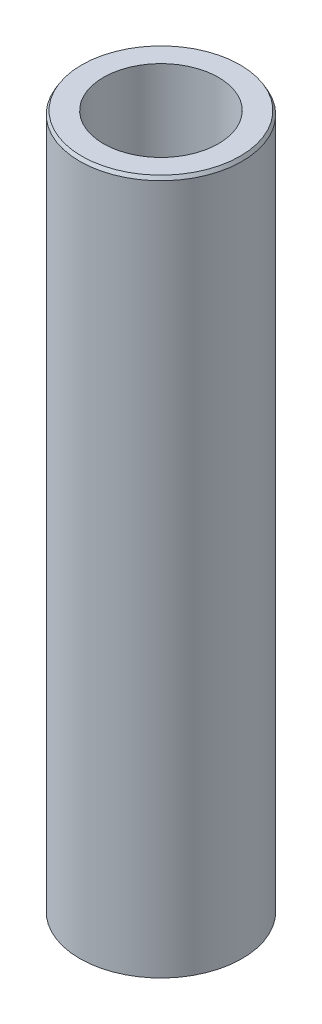
ISO-10303-21;
HEADER;
FILE_DESCRIPTION(('STEP AP214'),'2;1');
FILE_NAME('part.step','',(''),(''),'','','');
FILE_SCHEMA(('AUTOMOTIVE_DESIGN { 1 0 10303 214 1 1 1 1 }'));
ENDSEC;
DATA;
#1=APPLICATION_CONTEXT('core data for automotive mechanical design processes');
#2=APPLICATION_PROTOCOL_DEFINITION('international standard','automotive_design',2000,#1);
#3=PRODUCT_CONTEXT('',#1,'mechanical');
#4=PRODUCT('Part','Part','',(#3));
#5=PRODUCT_RELATED_PRODUCT_CATEGORY('part','',(#4));
#6=PRODUCT_DEFINITION_FORMATION('','',#4);
#7=PRODUCT_DEFINITION_CONTEXT('part definition',#1,'design');
#8=PRODUCT_DEFINITION('design','',#6,#7);
#9=PRODUCT_DEFINITION_SHAPE('','',#8);
#10=(LENGTH_UNIT() NAMED_UNIT(*) SI_UNIT(.MILLI.,.METRE.));
#11=(NAMED_UNIT(*) PLANE_ANGLE_UNIT() SI_UNIT($,.RADIAN.));
#12=(NAMED_UNIT(*) SI_UNIT($,.STERADIAN.) SOLID_ANGLE_UNIT());
#13=UNCERTAINTY_MEASURE_WITH_UNIT(LENGTH_MEASURE(1.E-05),#10,'distance_accuracy_value','');
#14=(GEOMETRIC_REPRESENTATION_CONTEXT(3) GLOBAL_UNCERTAINTY_ASSIGNED_CONTEXT((#13)) GLOBAL_UNIT_ASSIGNED_CONTEXT((#10,
#11,#12)) REPRESENTATION_CONTEXT('',''));
#15=CARTESIAN_POINT('',(0.,0.,0.));
#16=DIRECTION('',(0.,0.,1.));
#17=DIRECTION('',(1.,0.,0.));
#18=AXIS2_PLACEMENT_3D('',#15,#16,#17);
#19=CARTESIAN_POINT('',(0.,235.802418909913,0.));
#20=DIRECTION('',(0.,-1.,0.));
#21=DIRECTION('',(0.,0.,-1.));
#22=AXIS2_PLACEMENT_3D('',#19,#20,#21);
#23=CYLINDRICAL_SURFACE('',#22,27.5);
#24=CARTESIAN_POINT('',(0.,234.63679662006,0.));
#25=DIRECTION('',(0.,1.,0.));
#26=DIRECTION('',(0.,0.,1.));
#27=AXIS2_PLACEMENT_3D('',#24,#25,#26);
#28=CIRCLE('',#27,27.5);
#29=CARTESIAN_POINT('',(0.,234.63679662006,27.5));
#30=VERTEX_POINT('',#29);
#31=EDGE_CURVE('E50',#30,#30,#28,.F.);
#32=ORIENTED_EDGE('',*,*,#31,.T.);
#33=EDGE_LOOP('',(#32));
#34=FACE_BOUND('',#33,.T.);
#35=CARTESIAN_POINT('',(0.,0.672972342820266,0.));
#36=DIRECTION('',(0.,1.,0.));
#37=DIRECTION('',(0.,0.,1.));
#38=AXIS2_PLACEMENT_3D('',#35,#36,#37);
#39=CIRCLE('',#38,27.5);
#40=CARTESIAN_POINT('',(0.,0.672972342820266,27.5));
#41=VERTEX_POINT('',#40);
#42=EDGE_CURVE('E51',#41,#41,#39,.T.);
#43=ORIENTED_EDGE('',*,*,#42,.T.);
#44=EDGE_LOOP('',(#43));
#45=FACE_BOUND('',#44,.T.);
#46=ADVANCED_FACE('F39',(#34,#45),#23,.T.);
#47=CARTESIAN_POINT('',(0.,235.802418909913,0.));
#48=DIRECTION('',(0.,1.,0.));
#49=DIRECTION('',(0.,0.,1.));
#50=AXIS2_PLACEMENT_3D('',#47,#48,#49);
#51=PLANE('',#50);
#52=CARTESIAN_POINT('',(0.,235.802418909913,0.));
#53=DIRECTION('',(0.,1.,0.));
#54=DIRECTION('',(0.,0.,1.));
#55=AXIS2_PLACEMENT_3D('',#52,#53,#54);
#56=CIRCLE('',#55,26.8270276571798);
#57=CARTESIAN_POINT('',(0.,235.802418909913,26.8270276571798));
#58=VERTEX_POINT('',#57);
#59=EDGE_CURVE('E54',#58,#58,#56,.T.);
#60=ORIENTED_EDGE('',*,*,#59,.T.);
#61=EDGE_LOOP('',(#60));
#62=FACE_BOUND('',#61,.T.);
#63=CARTESIAN_POINT('',(0.,235.802418909913,0.));
#64=DIRECTION('',(0.,1.,0.));
#65=DIRECTION('',(0.,0.,1.));
#66=AXIS2_PLACEMENT_3D('',#63,#64,#65);
#67=CIRCLE('',#66,19.4872582917109);
#68=CARTESIAN_POINT('',(0.,235.802418909913,19.4872582917109));
#69=VERTEX_POINT('',#68);
#70=EDGE_CURVE('E58',#69,#69,#67,.T.);
#71=ORIENTED_EDGE('',*,*,#70,.F.);
#72=EDGE_LOOP('',(#71));
#73=FACE_BOUND('',#72,.T.);
#74=ADVANCED_FACE('F69',(#62,#73),#51,.T.);
#75=CARTESIAN_POINT('',(0.,0.,0.));
#76=DIRECTION('',(0.,1.,0.));
#77=DIRECTION('',(0.,0.,1.));
#78=AXIS2_PLACEMENT_3D('',#75,#76,#77);
#79=PLANE('',#78);
#80=CARTESIAN_POINT('',(0.,0.,0.));
#81=DIRECTION('',(0.,1.,0.));
#82=DIRECTION('',(0.,0.,1.));
#83=AXIS2_PLACEMENT_3D('',#80,#81,#82);
#84=CIRCLE('',#83,26.3343777101466);
#85=CARTESIAN_POINT('',(0.,0.,26.3343777101466));
#86=VERTEX_POINT('',#85);
#87=EDGE_CURVE('E10',#86,#86,#84,.F.);
#88=ORIENTED_EDGE('',*,*,#87,.T.);
#89=EDGE_LOOP('',(#88));
#90=FACE_BOUND('',#89,.T.);
#91=CARTESIAN_POINT('',(0.,0.,0.));
#92=DIRECTION('',(0.,1.,0.));
#93=DIRECTION('',(0.,0.,1.));
#94=AXIS2_PLACEMENT_3D('',#91,#92,#93);
#95=CIRCLE('',#94,19.4872582917109);
#96=CARTESIAN_POINT('',(0.,0.,19.4872582917109));
#97=VERTEX_POINT('',#96);
#98=EDGE_CURVE('E63',#97,#97,#95,.T.);
#99=ORIENTED_EDGE('',*,*,#98,.T.);
#100=EDGE_LOOP('',(#99));
#101=FACE_BOUND('',#100,.T.);
#102=ADVANCED_FACE('F75',(#90,#101),#79,.F.);
#103=CARTESIAN_POINT('',(0.,235.802418909913,0.));
#104=DIRECTION('',(0.,-1.,0.));
#105=DIRECTION('',(0.,0.,-1.));
#106=AXIS2_PLACEMENT_3D('',#103,#104,#105);
#107=CYLINDRICAL_SURFACE('',#106,19.4872582917109);
#108=ORIENTED_EDGE('',*,*,#70,.T.);
#109=EDGE_LOOP('',(#108));
#110=FACE_BOUND('',#109,.T.);
#111=ORIENTED_EDGE('',*,*,#98,.F.);
#112=EDGE_LOOP('',(#111));
#113=FACE_BOUND('',#112,.T.);
#114=ADVANCED_FACE('F70',(#110,#113),#107,.F.);
#115=CARTESIAN_POINT('',(0.,235.802418909913,0.));
#116=DIRECTION('',(0.,-1.,0.));
#117=DIRECTION('',(0.,0.,-1.));
#118=AXIS2_PLACEMENT_3D('',#115,#116,#117);
#119=CONICAL_SURFACE('',#118,26.8270276571798,0.523598775598314);
#120=ORIENTED_EDGE('',*,*,#31,.F.);
#121=EDGE_LOOP('',(#120));
#122=FACE_BOUND('',#121,.T.);
#123=ORIENTED_EDGE('',*,*,#59,.F.);
#124=EDGE_LOOP('',(#123));
#125=FACE_BOUND('',#124,.T.);
#126=ADVANCED_FACE('F81',(#122,#125),#119,.T.);
#127=CARTESIAN_POINT('',(0.,0.672972342820266,0.));
#128=DIRECTION('',(0.,1.,0.));
#129=DIRECTION('',(0.,0.,1.));
#130=AXIS2_PLACEMENT_3D('',#127,#128,#129);
#131=CONICAL_SURFACE('',#130,27.5,1.0471975511966);
#132=ORIENTED_EDGE('',*,*,#87,.F.);
#133=EDGE_LOOP('',(#132));
#134=FACE_BOUND('',#133,.T.);
#135=ORIENTED_EDGE('',*,*,#42,.F.);
#136=EDGE_LOOP('',(#135));
#137=FACE_BOUND('',#136,.T.);
#138=ADVANCED_FACE('F45',(#134,#137),#131,.T.);
#139=CLOSED_SHELL('',(#46,#74,#102,#114,#126,#138));
#140=MANIFOLD_SOLID_BREP('B2',#139);
#141=ADVANCED_BREP_SHAPE_REPRESENTATION('',(#18,#140),#14);
#142=SHAPE_DEFINITION_REPRESENTATION(#9,#141);
ENDSEC;
END-ISO-10303-21;
